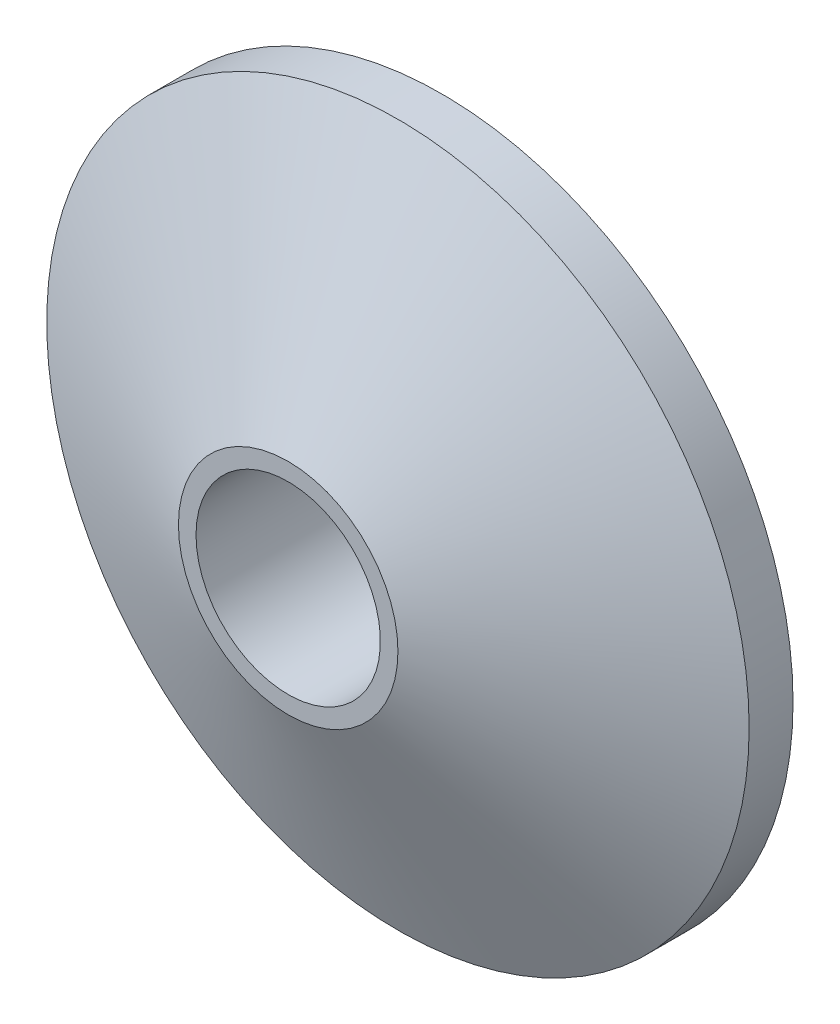
ISO-10303-21;
HEADER;
FILE_DESCRIPTION(('STEP AP214'),'2;1');
FILE_NAME('part.step','',(''),(''),'','','');
FILE_SCHEMA(('AUTOMOTIVE_DESIGN { 1 0 10303 214 1 1 1 1 }'));
ENDSEC;
DATA;
#1=APPLICATION_CONTEXT('core data for automotive mechanical design processes');
#2=APPLICATION_PROTOCOL_DEFINITION('international standard','automotive_design',2000,#1);
#3=PRODUCT_CONTEXT('',#1,'mechanical');
#4=PRODUCT('Part','Part','',(#3));
#5=PRODUCT_RELATED_PRODUCT_CATEGORY('part','',(#4));
#6=PRODUCT_DEFINITION_FORMATION('','',#4);
#7=PRODUCT_DEFINITION_CONTEXT('part definition',#1,'design');
#8=PRODUCT_DEFINITION('design','',#6,#7);
#9=PRODUCT_DEFINITION_SHAPE('','',#8);
#10=(LENGTH_UNIT() NAMED_UNIT(*) SI_UNIT(.MILLI.,.METRE.));
#11=(NAMED_UNIT(*) PLANE_ANGLE_UNIT() SI_UNIT($,.RADIAN.));
#12=(NAMED_UNIT(*) SI_UNIT($,.STERADIAN.) SOLID_ANGLE_UNIT());
#13=UNCERTAINTY_MEASURE_WITH_UNIT(LENGTH_MEASURE(1.E-05),#10,'distance_accuracy_value','');
#14=(GEOMETRIC_REPRESENTATION_CONTEXT(3) GLOBAL_UNCERTAINTY_ASSIGNED_CONTEXT((#13)) GLOBAL_UNIT_ASSIGNED_CONTEXT((#10,
#11,#12)) REPRESENTATION_CONTEXT('',''));
#15=CARTESIAN_POINT('',(0.,0.,0.));
#16=DIRECTION('',(0.,0.,1.));
#17=DIRECTION('',(1.,0.,0.));
#18=AXIS2_PLACEMENT_3D('',#15,#16,#17);
#19=CARTESIAN_POINT('',(0.,0.,3.5));
#20=DIRECTION('',(0.,0.,-1.));
#21=DIRECTION('',(-1.,0.,0.));
#22=AXIS2_PLACEMENT_3D('',#19,#20,#21);
#23=CYLINDRICAL_SURFACE('',#22,8.);
#24=CARTESIAN_POINT('',(0.,0.,0.999999999999996));
#25=DIRECTION('',(0.,0.,1.));
#26=DIRECTION('',(1.,0.,0.));
#27=AXIS2_PLACEMENT_3D('',#24,#25,#26);
#28=CIRCLE('',#27,8.);
#29=CARTESIAN_POINT('',(8.,0.,0.999999999999996));
#30=VERTEX_POINT('',#29);
#31=EDGE_CURVE('E10',#30,#30,#28,.F.);
#32=ORIENTED_EDGE('',*,*,#31,.T.);
#33=EDGE_LOOP('',(#32));
#34=FACE_BOUND('',#33,.T.);
#35=CARTESIAN_POINT('',(0.,0.,0.));
#36=DIRECTION('',(0.,0.,1.));
#37=DIRECTION('',(1.,0.,0.));
#38=AXIS2_PLACEMENT_3D('',#35,#36,#37);
#39=CIRCLE('',#38,8.);
#40=CARTESIAN_POINT('',(8.,0.,0.));
#41=VERTEX_POINT('',#40);
#42=EDGE_CURVE('E39',#41,#41,#39,.T.);
#43=ORIENTED_EDGE('',*,*,#42,.T.);
#44=EDGE_LOOP('',(#43));
#45=FACE_BOUND('',#44,.T.);
#46=ADVANCED_FACE('F28',(#34,#45),#23,.T.);
#47=CARTESIAN_POINT('',(0.,0.,3.5));
#48=DIRECTION('',(0.,0.,1.));
#49=DIRECTION('',(1.,0.,0.));
#50=AXIS2_PLACEMENT_3D('',#47,#48,#49);
#51=PLANE('',#50);
#52=CARTESIAN_POINT('',(0.,0.,3.5));
#53=DIRECTION('',(0.,0.,-1.));
#54=DIRECTION('',(-1.,0.,0.));
#55=AXIS2_PLACEMENT_3D('',#52,#53,#54);
#56=CIRCLE('',#55,2.1);
#57=CARTESIAN_POINT('',(-2.1,0.,3.5));
#58=VERTEX_POINT('',#57);
#59=EDGE_CURVE('E43',#58,#58,#56,.T.);
#60=ORIENTED_EDGE('',*,*,#59,.T.);
#61=EDGE_LOOP('',(#60));
#62=FACE_BOUND('',#61,.T.);
#63=CARTESIAN_POINT('',(0.,0.,3.5));
#64=DIRECTION('',(0.,0.,1.));
#65=DIRECTION('',(1.,0.,0.));
#66=AXIS2_PLACEMENT_3D('',#63,#64,#65);
#67=CIRCLE('',#66,2.49999999999996);
#68=CARTESIAN_POINT('',(2.49999999999996,0.,3.5));
#69=VERTEX_POINT('',#68);
#70=EDGE_CURVE('E35',#69,#69,#67,.T.);
#71=ORIENTED_EDGE('',*,*,#70,.T.);
#72=EDGE_LOOP('',(#71));
#73=FACE_BOUND('',#72,.T.);
#74=ADVANCED_FACE('F57',(#62,#73),#51,.T.);
#75=CARTESIAN_POINT('',(0.,0.,0.));
#76=DIRECTION('',(0.,0.,1.));
#77=DIRECTION('',(1.,0.,0.));
#78=AXIS2_PLACEMENT_3D('',#75,#76,#77);
#79=PLANE('',#78);
#80=CARTESIAN_POINT('',(0.,0.,0.));
#81=DIRECTION('',(0.,0.,-1.));
#82=DIRECTION('',(-1.,0.,0.));
#83=AXIS2_PLACEMENT_3D('',#80,#81,#82);
#84=CIRCLE('',#83,2.09999999999999);
#85=CARTESIAN_POINT('',(-2.09999999999999,0.,0.));
#86=VERTEX_POINT('',#85);
#87=EDGE_CURVE('E48',#86,#86,#84,.T.);
#88=ORIENTED_EDGE('',*,*,#87,.F.);
#89=EDGE_LOOP('',(#88));
#90=FACE_BOUND('',#89,.T.);
#91=ORIENTED_EDGE('',*,*,#42,.F.);
#92=EDGE_LOOP('',(#91));
#93=FACE_BOUND('',#92,.T.);
#94=ADVANCED_FACE('F54',(#90,#93),#79,.F.);
#95=CARTESIAN_POINT('',(0.,0.,3.5));
#96=DIRECTION('',(0.,0.,-1.));
#97=DIRECTION('',(-1.,0.,0.));
#98=AXIS2_PLACEMENT_3D('',#95,#96,#97);
#99=CONICAL_SURFACE('',#98,2.49999999999996,1.14416883366802);
#100=ORIENTED_EDGE('',*,*,#31,.F.);
#101=EDGE_LOOP('',(#100));
#102=FACE_BOUND('',#101,.T.);
#103=ORIENTED_EDGE('',*,*,#70,.F.);
#104=EDGE_LOOP('',(#103));
#105=FACE_BOUND('',#104,.T.);
#106=ADVANCED_FACE('F30',(#102,#105),#99,.T.);
#107=CARTESIAN_POINT('',(0.,0.,0.));
#108=DIRECTION('',(0.,0.,-1.));
#109=DIRECTION('',(-1.,0.,0.));
#110=AXIS2_PLACEMENT_3D('',#107,#108,#109);
#111=CYLINDRICAL_SURFACE('',#110,2.09999999999999);
#112=ORIENTED_EDGE('',*,*,#59,.F.);
#113=EDGE_LOOP('',(#112));
#114=FACE_BOUND('',#113,.T.);
#115=ORIENTED_EDGE('',*,*,#87,.T.);
#116=EDGE_LOOP('',(#115));
#117=FACE_BOUND('',#116,.T.);
#118=ADVANCED_FACE('F52',(#114,#117),#111,.F.);
#119=CLOSED_SHELL('',(#46,#74,#94,#106,#118));
#120=MANIFOLD_SOLID_BREP('B2',#119);
#121=ADVANCED_BREP_SHAPE_REPRESENTATION('',(#18,#120),#14);
#122=SHAPE_DEFINITION_REPRESENTATION(#9,#121);
ENDSEC;
END-ISO-10303-21;
